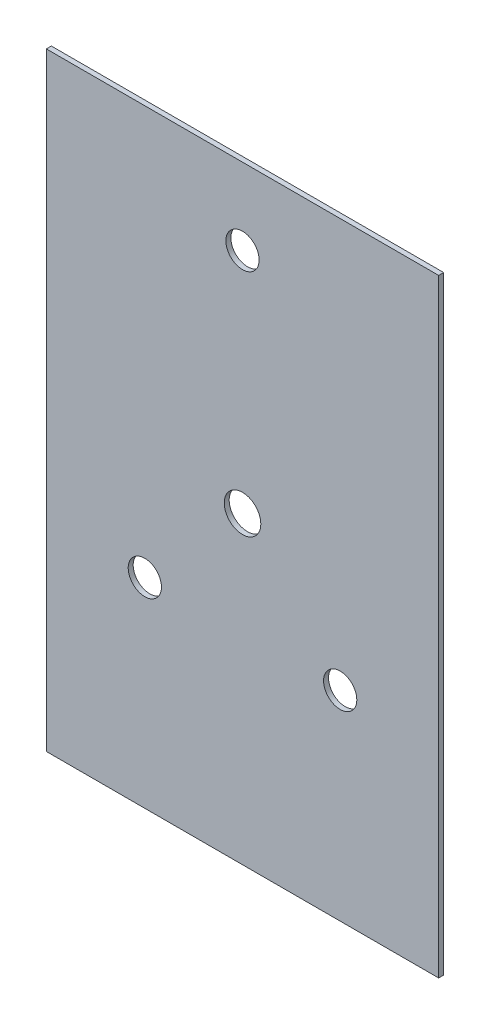
ISO-10303-21;
HEADER;
FILE_DESCRIPTION(('STEP AP214'),'2;1');
FILE_NAME('part.step','',(''),(''),'','','');
FILE_SCHEMA(('AUTOMOTIVE_DESIGN { 1 0 10303 214 1 1 1 1 }'));
ENDSEC;
DATA;
#1=APPLICATION_CONTEXT('core data for automotive mechanical design processes');
#2=APPLICATION_PROTOCOL_DEFINITION('international standard','automotive_design',2000,#1);
#3=PRODUCT_CONTEXT('',#1,'mechanical');
#4=PRODUCT('Part','Part','',(#3));
#5=PRODUCT_RELATED_PRODUCT_CATEGORY('part','',(#4));
#6=PRODUCT_DEFINITION_FORMATION('','',#4);
#7=PRODUCT_DEFINITION_CONTEXT('part definition',#1,'design');
#8=PRODUCT_DEFINITION('design','',#6,#7);
#9=PRODUCT_DEFINITION_SHAPE('','',#8);
#10=(LENGTH_UNIT() NAMED_UNIT(*) SI_UNIT(.MILLI.,.METRE.));
#11=(NAMED_UNIT(*) PLANE_ANGLE_UNIT() SI_UNIT($,.RADIAN.));
#12=(NAMED_UNIT(*) SI_UNIT($,.STERADIAN.) SOLID_ANGLE_UNIT());
#13=UNCERTAINTY_MEASURE_WITH_UNIT(LENGTH_MEASURE(1.E-05),#10,'distance_accuracy_value','');
#14=(GEOMETRIC_REPRESENTATION_CONTEXT(3) GLOBAL_UNCERTAINTY_ASSIGNED_CONTEXT((#13)) GLOBAL_UNIT_ASSIGNED_CONTEXT((#10,
#11,#12)) REPRESENTATION_CONTEXT('',''));
#15=CARTESIAN_POINT('',(0.,0.,0.));
#16=DIRECTION('',(0.,0.,1.));
#17=DIRECTION('',(1.,0.,0.));
#18=AXIS2_PLACEMENT_3D('',#15,#16,#17);
#19=CARTESIAN_POINT('',(118.,183.,3.));
#20=DIRECTION('',(-1.,0.,0.));
#21=DIRECTION('',(0.,-1.,0.));
#22=AXIS2_PLACEMENT_3D('',#19,#20,#21);
#23=PLANE('',#22);
#24=DIRECTION('',(0.,1.,0.));
#25=VECTOR('',#24,1.);
#26=CARTESIAN_POINT('',(118.,183.,0.));
#27=LINE('',#26,#25);
#28=CARTESIAN_POINT('',(118.,-183.,0.));
#29=VERTEX_POINT('',#28);
#30=CARTESIAN_POINT('',(118.,183.,0.));
#31=VERTEX_POINT('',#30);
#32=EDGE_CURVE('E103',#29,#31,#27,.T.);
#33=ORIENTED_EDGE('',*,*,#32,.T.);
#34=DIRECTION('',(0.,0.,-1.));
#35=VECTOR('',#34,1.);
#36=CARTESIAN_POINT('',(118.,183.,3.));
#37=LINE('',#36,#35);
#38=CARTESIAN_POINT('',(118.,183.,3.));
#39=VERTEX_POINT('',#38);
#40=EDGE_CURVE('E11',#39,#31,#37,.T.);
#41=ORIENTED_EDGE('',*,*,#40,.F.);
#42=DIRECTION('',(0.,1.,0.));
#43=VECTOR('',#42,1.);
#44=CARTESIAN_POINT('',(118.,183.,3.));
#45=LINE('',#44,#43);
#46=CARTESIAN_POINT('',(118.,-183.,3.));
#47=VERTEX_POINT('',#46);
#48=EDGE_CURVE('E91',#47,#39,#45,.T.);
#49=ORIENTED_EDGE('',*,*,#48,.F.);
#50=DIRECTION('',(0.,0.,-1.));
#51=VECTOR('',#50,1.);
#52=CARTESIAN_POINT('',(118.,-183.,3.));
#53=LINE('',#52,#51);
#54=EDGE_CURVE('E99',#47,#29,#53,.T.);
#55=ORIENTED_EDGE('',*,*,#54,.T.);
#56=EDGE_LOOP('',(#33,#41,#49,#55));
#57=FACE_BOUND('',#56,.T.);
#58=ADVANCED_FACE('F40',(#57),#23,.F.);
#59=CARTESIAN_POINT('',(-118.,183.,3.));
#60=DIRECTION('',(0.,-1.,0.));
#61=DIRECTION('',(0.,0.,-1.));
#62=AXIS2_PLACEMENT_3D('',#59,#60,#61);
#63=PLANE('',#62);
#64=DIRECTION('',(-1.,0.,0.));
#65=VECTOR('',#64,1.);
#66=CARTESIAN_POINT('',(-118.,183.,0.));
#67=LINE('',#66,#65);
#68=CARTESIAN_POINT('',(-118.,183.,0.));
#69=VERTEX_POINT('',#68);
#70=EDGE_CURVE('E95',#31,#69,#67,.T.);
#71=ORIENTED_EDGE('',*,*,#70,.T.);
#72=DIRECTION('',(0.,0.,-1.));
#73=VECTOR('',#72,1.);
#74=CARTESIAN_POINT('',(-118.,183.,3.));
#75=LINE('',#74,#73);
#76=CARTESIAN_POINT('',(-118.,183.,3.));
#77=VERTEX_POINT('',#76);
#78=EDGE_CURVE('E48',#77,#69,#75,.T.);
#79=ORIENTED_EDGE('',*,*,#78,.F.);
#80=DIRECTION('',(-1.,0.,0.));
#81=VECTOR('',#80,1.);
#82=CARTESIAN_POINT('',(-118.,183.,3.));
#83=LINE('',#82,#81);
#84=EDGE_CURVE('E86',#39,#77,#83,.T.);
#85=ORIENTED_EDGE('',*,*,#84,.F.);
#86=ORIENTED_EDGE('',*,*,#40,.T.);
#87=EDGE_LOOP('',(#71,#79,#85,#86));
#88=FACE_BOUND('',#87,.T.);
#89=ADVANCED_FACE('F94',(#88),#63,.F.);
#90=CARTESIAN_POINT('',(-118.,183.,3.));
#91=DIRECTION('',(1.,0.,0.));
#92=DIRECTION('',(0.,1.,0.));
#93=AXIS2_PLACEMENT_3D('',#90,#91,#92);
#94=PLANE('',#93);
#95=DIRECTION('',(0.,-1.,0.));
#96=VECTOR('',#95,1.);
#97=CARTESIAN_POINT('',(-118.,183.,0.));
#98=LINE('',#97,#96);
#99=CARTESIAN_POINT('',(-118.,-183.,0.));
#100=VERTEX_POINT('',#99);
#101=EDGE_CURVE('E73',#69,#100,#98,.T.);
#102=ORIENTED_EDGE('',*,*,#101,.T.);
#103=DIRECTION('',(0.,0.,-1.));
#104=VECTOR('',#103,1.);
#105=CARTESIAN_POINT('',(-118.,-183.,3.));
#106=LINE('',#105,#104);
#107=CARTESIAN_POINT('',(-118.,-183.,3.));
#108=VERTEX_POINT('',#107);
#109=EDGE_CURVE('E96',#108,#100,#106,.T.);
#110=ORIENTED_EDGE('',*,*,#109,.F.);
#111=DIRECTION('',(0.,-1.,0.));
#112=VECTOR('',#111,1.);
#113=CARTESIAN_POINT('',(-118.,183.,3.));
#114=LINE('',#113,#112);
#115=EDGE_CURVE('E89',#77,#108,#114,.T.);
#116=ORIENTED_EDGE('',*,*,#115,.F.);
#117=ORIENTED_EDGE('',*,*,#78,.T.);
#118=EDGE_LOOP('',(#102,#110,#116,#117));
#119=FACE_BOUND('',#118,.T.);
#120=ADVANCED_FACE('F97',(#119),#94,.F.);
#121=CARTESIAN_POINT('',(-118.,-183.,3.));
#122=DIRECTION('',(0.,1.,0.));
#123=DIRECTION('',(0.,0.,1.));
#124=AXIS2_PLACEMENT_3D('',#121,#122,#123);
#125=PLANE('',#124);
#126=DIRECTION('',(1.,0.,0.));
#127=VECTOR('',#126,1.);
#128=CARTESIAN_POINT('',(-118.,-183.,0.));
#129=LINE('',#128,#127);
#130=EDGE_CURVE('E79',#100,#29,#129,.T.);
#131=ORIENTED_EDGE('',*,*,#130,.T.);
#132=ORIENTED_EDGE('',*,*,#54,.F.);
#133=DIRECTION('',(1.,0.,0.));
#134=VECTOR('',#133,1.);
#135=CARTESIAN_POINT('',(-118.,-183.,3.));
#136=LINE('',#135,#134);
#137=EDGE_CURVE('E56',#108,#47,#136,.T.);
#138=ORIENTED_EDGE('',*,*,#137,.F.);
#139=ORIENTED_EDGE('',*,*,#109,.T.);
#140=EDGE_LOOP('',(#131,#132,#138,#139));
#141=FACE_BOUND('',#140,.T.);
#142=ADVANCED_FACE('F111',(#141),#125,.F.);
#143=CARTESIAN_POINT('',(0.,0.,3.));
#144=DIRECTION('',(0.,0.,1.));
#145=DIRECTION('',(1.,0.,0.));
#146=AXIS2_PLACEMENT_3D('',#143,#144,#145);
#147=PLANE('',#146);
#148=CARTESIAN_POINT('',(0.,137.015625,3.));
#149=DIRECTION('',(0.,0.,1.));
#150=DIRECTION('',(1.,0.,0.));
#151=AXIS2_PLACEMENT_3D('',#148,#149,#150);
#152=CIRCLE('',#151,10.);
#153=CARTESIAN_POINT('',(9.99999999999993,137.015625,3.));
#154=VERTEX_POINT('',#153);
#155=EDGE_CURVE('E123',#154,#154,#152,.T.);
#156=ORIENTED_EDGE('',*,*,#155,.F.);
#157=EDGE_LOOP('',(#156));
#158=FACE_BOUND('',#157,.T.);
#159=CARTESIAN_POINT('',(58.75,-62.7500000000001,3.));
#160=DIRECTION('',(0.,0.,1.));
#161=DIRECTION('',(1.,0.,0.));
#162=AXIS2_PLACEMENT_3D('',#159,#160,#161);
#163=CIRCLE('',#162,9.99999999999999);
#164=CARTESIAN_POINT('',(68.75,-62.7500000000001,3.));
#165=VERTEX_POINT('',#164);
#166=EDGE_CURVE('E130',#165,#165,#163,.T.);
#167=ORIENTED_EDGE('',*,*,#166,.F.);
#168=EDGE_LOOP('',(#167));
#169=FACE_BOUND('',#168,.T.);
#170=CARTESIAN_POINT('',(-58.75,-62.7500000000001,3.));
#171=DIRECTION('',(0.,0.,1.));
#172=DIRECTION('',(1.,0.,0.));
#173=AXIS2_PLACEMENT_3D('',#170,#171,#172);
#174=CIRCLE('',#173,10.);
#175=CARTESIAN_POINT('',(-48.75,-62.7500000000001,3.));
#176=VERTEX_POINT('',#175);
#177=EDGE_CURVE('E122',#176,#176,#174,.T.);
#178=ORIENTED_EDGE('',*,*,#177,.F.);
#179=EDGE_LOOP('',(#178));
#180=FACE_BOUND('',#179,.T.);
#181=CARTESIAN_POINT('',(0.,0.,3.));
#182=DIRECTION('',(0.,0.,1.));
#183=DIRECTION('',(1.,0.,0.));
#184=AXIS2_PLACEMENT_3D('',#181,#182,#183);
#185=CIRCLE('',#184,11.);
#186=CARTESIAN_POINT('',(11.,0.,3.));
#187=VERTEX_POINT('',#186);
#188=EDGE_CURVE('E119',#187,#187,#185,.T.);
#189=ORIENTED_EDGE('',*,*,#188,.F.);
#190=EDGE_LOOP('',(#189));
#191=FACE_BOUND('',#190,.T.);
#192=ORIENTED_EDGE('',*,*,#48,.T.);
#193=ORIENTED_EDGE('',*,*,#84,.T.);
#194=ORIENTED_EDGE('',*,*,#115,.T.);
#195=ORIENTED_EDGE('',*,*,#137,.T.);
#196=EDGE_LOOP('',(#192,#193,#194,#195));
#197=FACE_BOUND('',#196,.T.);
#198=ADVANCED_FACE('F87',(#158,#169,#180,#191,#197),#147,.T.);
#199=CARTESIAN_POINT('',(0.,0.,0.));
#200=DIRECTION('',(0.,0.,1.));
#201=DIRECTION('',(1.,0.,0.));
#202=AXIS2_PLACEMENT_3D('',#199,#200,#201);
#203=PLANE('',#202);
#204=CARTESIAN_POINT('',(0.,137.015625,0.));
#205=DIRECTION('',(0.,0.,1.));
#206=DIRECTION('',(1.,0.,0.));
#207=AXIS2_PLACEMENT_3D('',#204,#205,#206);
#208=CIRCLE('',#207,10.);
#209=CARTESIAN_POINT('',(9.99999999999993,137.015625,0.));
#210=VERTEX_POINT('',#209);
#211=EDGE_CURVE('E127',#210,#210,#208,.F.);
#212=ORIENTED_EDGE('',*,*,#211,.F.);
#213=EDGE_LOOP('',(#212));
#214=FACE_BOUND('',#213,.T.);
#215=CARTESIAN_POINT('',(58.75,-62.7500000000001,0.));
#216=DIRECTION('',(0.,0.,1.));
#217=DIRECTION('',(1.,0.,0.));
#218=AXIS2_PLACEMENT_3D('',#215,#216,#217);
#219=CIRCLE('',#218,9.99999999999999);
#220=CARTESIAN_POINT('',(68.75,-62.7500000000001,0.));
#221=VERTEX_POINT('',#220);
#222=EDGE_CURVE('E126',#221,#221,#219,.F.);
#223=ORIENTED_EDGE('',*,*,#222,.F.);
#224=EDGE_LOOP('',(#223));
#225=FACE_BOUND('',#224,.T.);
#226=CARTESIAN_POINT('',(-58.75,-62.7500000000001,0.));
#227=DIRECTION('',(0.,0.,1.));
#228=DIRECTION('',(1.,0.,0.));
#229=AXIS2_PLACEMENT_3D('',#226,#227,#228);
#230=CIRCLE('',#229,10.);
#231=CARTESIAN_POINT('',(-48.75,-62.7500000000001,0.));
#232=VERTEX_POINT('',#231);
#233=EDGE_CURVE('E133',#232,#232,#230,.F.);
#234=ORIENTED_EDGE('',*,*,#233,.F.);
#235=EDGE_LOOP('',(#234));
#236=FACE_BOUND('',#235,.T.);
#237=CARTESIAN_POINT('',(0.,0.,0.));
#238=DIRECTION('',(0.,0.,1.));
#239=DIRECTION('',(1.,0.,0.));
#240=AXIS2_PLACEMENT_3D('',#237,#238,#239);
#241=CIRCLE('',#240,11.);
#242=CARTESIAN_POINT('',(11.,0.,0.));
#243=VERTEX_POINT('',#242);
#244=EDGE_CURVE('E106',#243,#243,#241,.F.);
#245=ORIENTED_EDGE('',*,*,#244,.F.);
#246=EDGE_LOOP('',(#245));
#247=FACE_BOUND('',#246,.T.);
#248=ORIENTED_EDGE('',*,*,#32,.F.);
#249=ORIENTED_EDGE('',*,*,#130,.F.);
#250=ORIENTED_EDGE('',*,*,#101,.F.);
#251=ORIENTED_EDGE('',*,*,#70,.F.);
#252=EDGE_LOOP('',(#248,#249,#250,#251));
#253=FACE_BOUND('',#252,.T.);
#254=ADVANCED_FACE('F114',(#214,#225,#236,#247,#253),#203,.F.);
#255=CARTESIAN_POINT('',(0.,0.,-0.00100000000000013));
#256=DIRECTION('',(0.,0.,1.));
#257=DIRECTION('',(1.,0.,0.));
#258=AXIS2_PLACEMENT_3D('',#255,#256,#257);
#259=CYLINDRICAL_SURFACE('',#258,11.);
#260=ORIENTED_EDGE('',*,*,#188,.T.);
#261=EDGE_LOOP('',(#260));
#262=FACE_BOUND('',#261,.T.);
#263=ORIENTED_EDGE('',*,*,#244,.T.);
#264=EDGE_LOOP('',(#263));
#265=FACE_BOUND('',#264,.T.);
#266=ADVANCED_FACE('F145',(#262,#265),#259,.F.);
#267=CARTESIAN_POINT('',(-58.75,-62.7500000000001,-0.00100000000000013));
#268=DIRECTION('',(0.,0.,1.));
#269=DIRECTION('',(1.,0.,0.));
#270=AXIS2_PLACEMENT_3D('',#267,#268,#269);
#271=CYLINDRICAL_SURFACE('',#270,10.);
#272=ORIENTED_EDGE('',*,*,#177,.T.);
#273=EDGE_LOOP('',(#272));
#274=FACE_BOUND('',#273,.T.);
#275=ORIENTED_EDGE('',*,*,#233,.T.);
#276=EDGE_LOOP('',(#275));
#277=FACE_BOUND('',#276,.T.);
#278=ADVANCED_FACE('F141',(#274,#277),#271,.F.);
#279=CARTESIAN_POINT('',(58.75,-62.7500000000001,-0.00100000000000013));
#280=DIRECTION('',(0.,0.,1.));
#281=DIRECTION('',(1.,0.,0.));
#282=AXIS2_PLACEMENT_3D('',#279,#280,#281);
#283=CYLINDRICAL_SURFACE('',#282,9.99999999999999);
#284=ORIENTED_EDGE('',*,*,#166,.T.);
#285=EDGE_LOOP('',(#284));
#286=FACE_BOUND('',#285,.T.);
#287=ORIENTED_EDGE('',*,*,#222,.T.);
#288=EDGE_LOOP('',(#287));
#289=FACE_BOUND('',#288,.T.);
#290=ADVANCED_FACE('F156',(#286,#289),#283,.F.);
#291=CARTESIAN_POINT('',(0.,137.015625,-0.00100000000000013));
#292=DIRECTION('',(0.,0.,1.));
#293=DIRECTION('',(1.,0.,0.));
#294=AXIS2_PLACEMENT_3D('',#291,#292,#293);
#295=CYLINDRICAL_SURFACE('',#294,10.);
#296=ORIENTED_EDGE('',*,*,#155,.T.);
#297=EDGE_LOOP('',(#296));
#298=FACE_BOUND('',#297,.T.);
#299=ORIENTED_EDGE('',*,*,#211,.T.);
#300=EDGE_LOOP('',(#299));
#301=FACE_BOUND('',#300,.T.);
#302=ADVANCED_FACE('F185',(#298,#301),#295,.F.);
#303=CLOSED_SHELL('',(#58,#89,#120,#142,#198,#254,#266,#278,#290,#302));
#304=MANIFOLD_SOLID_BREP('B2',#303);
#305=ADVANCED_BREP_SHAPE_REPRESENTATION('',(#18,#304),#14);
#306=SHAPE_DEFINITION_REPRESENTATION(#9,#305);
ENDSEC;
END-ISO-10303-21;
